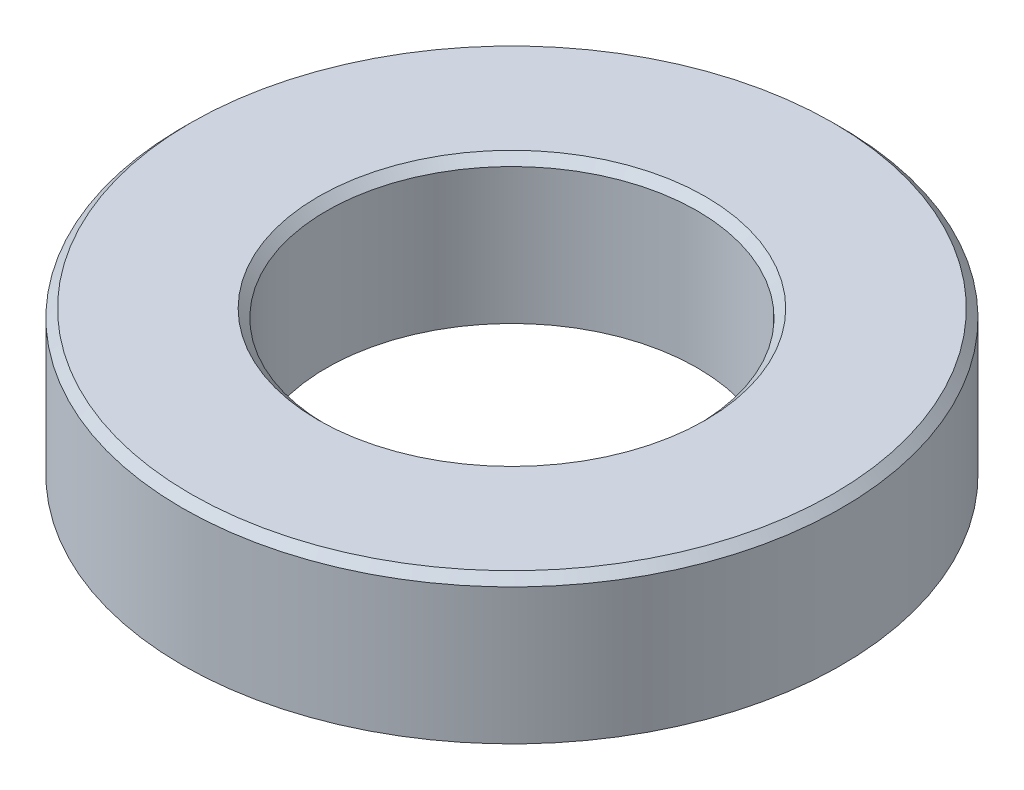
ISO-10303-21;
HEADER;
FILE_DESCRIPTION(('STEP AP214'),'2;1');
FILE_NAME('part.step','',(''),(''),'','','');
FILE_SCHEMA(('AUTOMOTIVE_DESIGN { 1 0 10303 214 1 1 1 1 }'));
ENDSEC;
DATA;
#1=APPLICATION_CONTEXT('core data for automotive mechanical design processes');
#2=APPLICATION_PROTOCOL_DEFINITION('international standard','automotive_design',2000,#1);
#3=PRODUCT_CONTEXT('',#1,'mechanical');
#4=PRODUCT('Part','Part','',(#3));
#5=PRODUCT_RELATED_PRODUCT_CATEGORY('part','',(#4));
#6=PRODUCT_DEFINITION_FORMATION('','',#4);
#7=PRODUCT_DEFINITION_CONTEXT('part definition',#1,'design');
#8=PRODUCT_DEFINITION('design','',#6,#7);
#9=PRODUCT_DEFINITION_SHAPE('','',#8);
#10=(LENGTH_UNIT() NAMED_UNIT(*) SI_UNIT(.MILLI.,.METRE.));
#11=(NAMED_UNIT(*) PLANE_ANGLE_UNIT() SI_UNIT($,.RADIAN.));
#12=(NAMED_UNIT(*) SI_UNIT($,.STERADIAN.) SOLID_ANGLE_UNIT());
#13=UNCERTAINTY_MEASURE_WITH_UNIT(LENGTH_MEASURE(1.E-05),#10,'distance_accuracy_value','');
#14=(GEOMETRIC_REPRESENTATION_CONTEXT(3) GLOBAL_UNCERTAINTY_ASSIGNED_CONTEXT((#13)) GLOBAL_UNIT_ASSIGNED_CONTEXT((#10,
#11,#12)) REPRESENTATION_CONTEXT('',''));
#15=CARTESIAN_POINT('',(0.,0.,0.));
#16=DIRECTION('',(0.,0.,1.));
#17=DIRECTION('',(1.,0.,0.));
#18=AXIS2_PLACEMENT_3D('',#15,#16,#17);
#19=CARTESIAN_POINT('',(0.,3.5,0.));
#20=DIRECTION('',(0.,1.,0.));
#21=DIRECTION('',(0.,0.,1.));
#22=AXIS2_PLACEMENT_3D('',#19,#20,#21);
#23=PLANE('',#22);
#24=CARTESIAN_POINT('',(0.,3.5,0.));
#25=DIRECTION('',(0.,1.,0.));
#26=DIRECTION('',(0.,0.,1.));
#27=AXIS2_PLACEMENT_3D('',#24,#25,#26);
#28=CIRCLE('',#27,4.7);
#29=CARTESIAN_POINT('',(0.,3.5,4.7));
#30=VERTEX_POINT('',#29);
#31=EDGE_CURVE('E46',#30,#30,#28,.F.);
#32=ORIENTED_EDGE('',*,*,#31,.T.);
#33=EDGE_LOOP('',(#32));
#34=FACE_BOUND('',#33,.T.);
#35=CARTESIAN_POINT('',(0.,3.5,0.));
#36=DIRECTION('',(0.,1.,0.));
#37=DIRECTION('',(0.,0.,1.));
#38=AXIS2_PLACEMENT_3D('',#35,#36,#37);
#39=CIRCLE('',#38,7.8);
#40=CARTESIAN_POINT('',(0.,3.5,7.8));
#41=VERTEX_POINT('',#40);
#42=EDGE_CURVE('E50',#41,#41,#39,.T.);
#43=ORIENTED_EDGE('',*,*,#42,.T.);
#44=EDGE_LOOP('',(#43));
#45=FACE_BOUND('',#44,.T.);
#46=ADVANCED_FACE('F38',(#34,#45),#23,.T.);
#47=CARTESIAN_POINT('',(0.,0.,0.));
#48=DIRECTION('',(0.,1.,0.));
#49=DIRECTION('',(0.,0.,1.));
#50=AXIS2_PLACEMENT_3D('',#47,#48,#49);
#51=PLANE('',#50);
#52=CARTESIAN_POINT('',(0.,0.,0.));
#53=DIRECTION('',(0.,1.,0.));
#54=DIRECTION('',(0.,0.,1.));
#55=AXIS2_PLACEMENT_3D('',#52,#53,#54);
#56=CIRCLE('',#55,8.);
#57=CARTESIAN_POINT('',(0.,0.,8.));
#58=VERTEX_POINT('',#57);
#59=EDGE_CURVE('E59',#58,#58,#56,.T.);
#60=ORIENTED_EDGE('',*,*,#59,.F.);
#61=EDGE_LOOP('',(#60));
#62=FACE_BOUND('',#61,.T.);
#63=CARTESIAN_POINT('',(0.,0.,0.));
#64=DIRECTION('',(0.,1.,0.));
#65=DIRECTION('',(0.,0.,1.));
#66=AXIS2_PLACEMENT_3D('',#63,#64,#65);
#67=CIRCLE('',#66,4.5);
#68=CARTESIAN_POINT('',(0.,0.,4.5));
#69=VERTEX_POINT('',#68);
#70=EDGE_CURVE('E62',#69,#69,#67,.T.);
#71=ORIENTED_EDGE('',*,*,#70,.T.);
#72=EDGE_LOOP('',(#71));
#73=FACE_BOUND('',#72,.T.);
#74=ADVANCED_FACE('F66',(#62,#73),#51,.F.);
#75=CARTESIAN_POINT('',(0.,3.5,0.));
#76=DIRECTION('',(0.,-1.,0.));
#77=DIRECTION('',(0.,0.,-1.));
#78=AXIS2_PLACEMENT_3D('',#75,#76,#77);
#79=CYLINDRICAL_SURFACE('',#78,8.);
#80=CARTESIAN_POINT('',(0.,3.3,0.));
#81=DIRECTION('',(0.,1.,0.));
#82=DIRECTION('',(0.,0.,1.));
#83=AXIS2_PLACEMENT_3D('',#80,#81,#82);
#84=CIRCLE('',#83,8.);
#85=CARTESIAN_POINT('',(0.,3.3,8.));
#86=VERTEX_POINT('',#85);
#87=EDGE_CURVE('E10',#86,#86,#84,.F.);
#88=ORIENTED_EDGE('',*,*,#87,.T.);
#89=EDGE_LOOP('',(#88));
#90=FACE_BOUND('',#89,.T.);
#91=ORIENTED_EDGE('',*,*,#59,.T.);
#92=EDGE_LOOP('',(#91));
#93=FACE_BOUND('',#92,.T.);
#94=ADVANCED_FACE('F71',(#90,#93),#79,.T.);
#95=CARTESIAN_POINT('',(0.,3.5,0.));
#96=DIRECTION('',(0.,-1.,0.));
#97=DIRECTION('',(0.,0.,-1.));
#98=AXIS2_PLACEMENT_3D('',#95,#96,#97);
#99=CYLINDRICAL_SURFACE('',#98,4.5);
#100=CARTESIAN_POINT('',(0.,3.3,0.));
#101=DIRECTION('',(0.,1.,0.));
#102=DIRECTION('',(0.,0.,1.));
#103=AXIS2_PLACEMENT_3D('',#100,#101,#102);
#104=CIRCLE('',#103,4.5);
#105=CARTESIAN_POINT('',(0.,3.3,4.5));
#106=VERTEX_POINT('',#105);
#107=EDGE_CURVE('E54',#106,#106,#104,.T.);
#108=ORIENTED_EDGE('',*,*,#107,.T.);
#109=EDGE_LOOP('',(#108));
#110=FACE_BOUND('',#109,.T.);
#111=ORIENTED_EDGE('',*,*,#70,.F.);
#112=EDGE_LOOP('',(#111));
#113=FACE_BOUND('',#112,.T.);
#114=ADVANCED_FACE('F68',(#110,#113),#99,.F.);
#115=CARTESIAN_POINT('',(0.,3.3,0.));
#116=DIRECTION('',(0.,1.,0.));
#117=DIRECTION('',(0.,0.,1.));
#118=AXIS2_PLACEMENT_3D('',#115,#116,#117);
#119=CONICAL_SURFACE('',#118,4.5,0.785398163397448);
#120=ORIENTED_EDGE('',*,*,#31,.F.);
#121=EDGE_LOOP('',(#120));
#122=FACE_BOUND('',#121,.T.);
#123=ORIENTED_EDGE('',*,*,#107,.F.);
#124=EDGE_LOOP('',(#123));
#125=FACE_BOUND('',#124,.T.);
#126=ADVANCED_FACE('F70',(#122,#125),#119,.F.);
#127=CARTESIAN_POINT('',(0.,3.5,0.));
#128=DIRECTION('',(0.,-1.,0.));
#129=DIRECTION('',(0.,0.,-1.));
#130=AXIS2_PLACEMENT_3D('',#127,#128,#129);
#131=CONICAL_SURFACE('',#130,7.8,0.785398163397448);
#132=ORIENTED_EDGE('',*,*,#87,.F.);
#133=EDGE_LOOP('',(#132));
#134=FACE_BOUND('',#133,.T.);
#135=ORIENTED_EDGE('',*,*,#42,.F.);
#136=EDGE_LOOP('',(#135));
#137=FACE_BOUND('',#136,.T.);
#138=ADVANCED_FACE('F41',(#134,#137),#131,.T.);
#139=CLOSED_SHELL('',(#46,#74,#94,#114,#126,#138));
#140=MANIFOLD_SOLID_BREP('B2',#139);
#141=ADVANCED_BREP_SHAPE_REPRESENTATION('',(#18,#140),#14);
#142=SHAPE_DEFINITION_REPRESENTATION(#9,#141);
ENDSEC;
END-ISO-10303-21;
